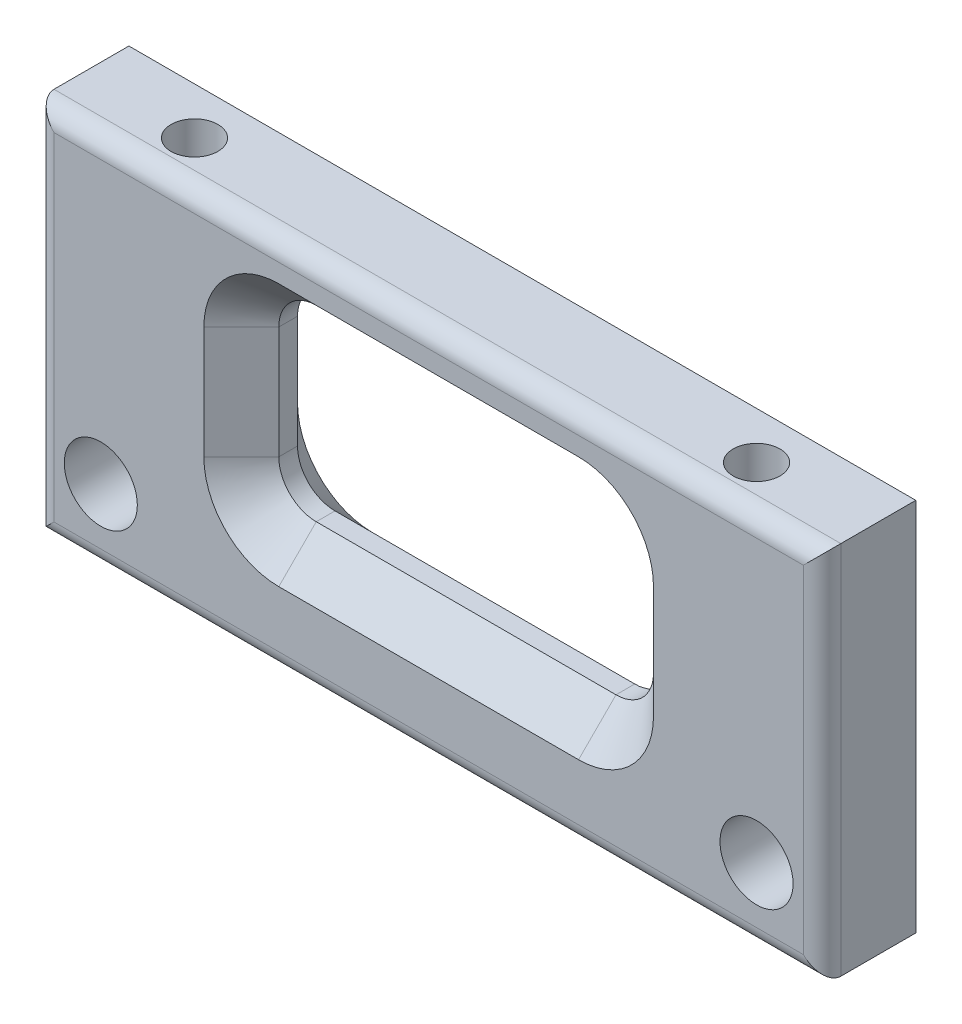
ISO-10303-21;
HEADER;
FILE_DESCRIPTION(('STEP AP214'),'2;1');
FILE_NAME('part.step','',(''),(''),'','','');
FILE_SCHEMA(('AUTOMOTIVE_DESIGN { 1 0 10303 214 1 1 1 1 }'));
ENDSEC;
DATA;
#1=APPLICATION_CONTEXT('core data for automotive mechanical design processes');
#2=APPLICATION_PROTOCOL_DEFINITION('international standard','automotive_design',2000,#1);
#3=PRODUCT_CONTEXT('',#1,'mechanical');
#4=PRODUCT('Part','Part','',(#3));
#5=PRODUCT_RELATED_PRODUCT_CATEGORY('part','',(#4));
#6=PRODUCT_DEFINITION_FORMATION('','',#4);
#7=PRODUCT_DEFINITION_CONTEXT('part definition',#1,'design');
#8=PRODUCT_DEFINITION('design','',#6,#7);
#9=PRODUCT_DEFINITION_SHAPE('','',#8);
#10=(LENGTH_UNIT() NAMED_UNIT(*) SI_UNIT(.MILLI.,.METRE.));
#11=(NAMED_UNIT(*) PLANE_ANGLE_UNIT() SI_UNIT($,.RADIAN.));
#12=(NAMED_UNIT(*) SI_UNIT($,.STERADIAN.) SOLID_ANGLE_UNIT());
#13=UNCERTAINTY_MEASURE_WITH_UNIT(LENGTH_MEASURE(1.E-05),#10,'distance_accuracy_value','');
#14=(GEOMETRIC_REPRESENTATION_CONTEXT(3) GLOBAL_UNCERTAINTY_ASSIGNED_CONTEXT((#13)) GLOBAL_UNIT_ASSIGNED_CONTEXT((#10,
#11,#12)) REPRESENTATION_CONTEXT('',''));
#15=CARTESIAN_POINT('',(0.,0.,0.));
#16=DIRECTION('',(0.,0.,1.));
#17=DIRECTION('',(1.,0.,0.));
#18=AXIS2_PLACEMENT_3D('',#15,#16,#17);
#19=CARTESIAN_POINT('',(0.,0.,5.));
#20=DIRECTION('',(0.,0.,1.));
#21=DIRECTION('',(1.,0.,0.));
#22=AXIS2_PLACEMENT_3D('',#19,#20,#21);
#23=PLANE('',#22);
#24=CARTESIAN_POINT('',(13.,-5.9903461742617,5.));
#25=DIRECTION('',(0.,0.,1.));
#26=DIRECTION('',(1.,0.,0.));
#27=AXIS2_PLACEMENT_3D('',#24,#25,#26);
#28=CIRCLE('',#27,4.00000000000001);
#29=CARTESIAN_POINT('',(8.99999999999999,-5.99034617426173,5.));
#30=VERTEX_POINT('',#29);
#31=CARTESIAN_POINT('',(13.,-1.99034617426169,5.));
#32=VERTEX_POINT('',#31);
#33=EDGE_CURVE('E51',#30,#32,#28,.F.);
#34=ORIENTED_EDGE('',*,*,#33,.T.);
#35=DIRECTION('',(1.,0.,0.));
#36=VECTOR('',#35,1.);
#37=CARTESIAN_POINT('',(29.,-1.99034617426169,5.));
#38=LINE('',#37,#36);
#39=CARTESIAN_POINT('',(29.,-1.99034617426169,5.));
#40=VERTEX_POINT('',#39);
#41=EDGE_CURVE('E11',#32,#40,#38,.T.);
#42=ORIENTED_EDGE('',*,*,#41,.T.);
#43=CARTESIAN_POINT('',(29.,-5.9903461742617,5.));
#44=DIRECTION('',(0.,0.,1.));
#45=DIRECTION('',(1.,0.,0.));
#46=AXIS2_PLACEMENT_3D('',#43,#44,#45);
#47=CIRCLE('',#46,4.00000000000001);
#48=CARTESIAN_POINT('',(33.,-5.99034617426172,5.));
#49=VERTEX_POINT('',#48);
#50=EDGE_CURVE('E323',#40,#49,#47,.F.);
#51=ORIENTED_EDGE('',*,*,#50,.T.);
#52=DIRECTION('',(0.,-1.,0.));
#53=VECTOR('',#52,1.);
#54=CARTESIAN_POINT('',(33.,-11.9903461742617,5.));
#55=LINE('',#54,#53);
#56=CARTESIAN_POINT('',(33.,-11.9903461742617,5.));
#57=VERTEX_POINT('',#56);
#58=EDGE_CURVE('E319',#49,#57,#55,.T.);
#59=ORIENTED_EDGE('',*,*,#58,.T.);
#60=CARTESIAN_POINT('',(29.,-11.9903461742617,5.));
#61=DIRECTION('',(0.,0.,1.));
#62=DIRECTION('',(1.,0.,0.));
#63=AXIS2_PLACEMENT_3D('',#60,#61,#62);
#64=CIRCLE('',#63,4.00000000000001);
#65=CARTESIAN_POINT('',(29.,-15.9903461742617,5.));
#66=VERTEX_POINT('',#65);
#67=EDGE_CURVE('E315',#57,#66,#64,.F.);
#68=ORIENTED_EDGE('',*,*,#67,.T.);
#69=DIRECTION('',(-1.,0.,0.));
#70=VECTOR('',#69,1.);
#71=CARTESIAN_POINT('',(13.,-15.9903461742617,5.));
#72=LINE('',#71,#70);
#73=CARTESIAN_POINT('',(13.,-15.9903461742617,5.));
#74=VERTEX_POINT('',#73);
#75=EDGE_CURVE('E313',#66,#74,#72,.T.);
#76=ORIENTED_EDGE('',*,*,#75,.T.);
#77=CARTESIAN_POINT('',(13.,-11.9903461742617,5.));
#78=DIRECTION('',(0.,0.,1.));
#79=DIRECTION('',(1.,0.,0.));
#80=AXIS2_PLACEMENT_3D('',#77,#78,#79);
#81=CIRCLE('',#80,4.00000000000001);
#82=CARTESIAN_POINT('',(8.99999999999999,-11.9903461742617,5.));
#83=VERTEX_POINT('',#82);
#84=EDGE_CURVE('E317',#74,#83,#81,.F.);
#85=ORIENTED_EDGE('',*,*,#84,.T.);
#86=DIRECTION('',(0.,1.,0.));
#87=VECTOR('',#86,1.);
#88=CARTESIAN_POINT('',(8.99999999999999,-5.99034617426171,5.));
#89=LINE('',#88,#87);
#90=EDGE_CURVE('E321',#83,#30,#89,.T.);
#91=ORIENTED_EDGE('',*,*,#90,.T.);
#92=EDGE_LOOP('',(#34,#42,#51,#59,#68,#76,#85,#91));
#93=FACE_BOUND('',#92,.T.);
#94=DIRECTION('',(1.,0.,0.));
#95=VECTOR('',#94,1.);
#96=CARTESIAN_POINT('',(42.,-19.,5.));
#97=LINE('',#96,#95);
#98=CARTESIAN_POINT('',(1.,-19.,5.));
#99=VERTEX_POINT('',#98);
#100=CARTESIAN_POINT('',(41.,-19.,5.));
#101=VERTEX_POINT('',#100);
#102=EDGE_CURVE('E204',#99,#101,#97,.T.);
#103=ORIENTED_EDGE('',*,*,#102,.T.);
#104=DIRECTION('',(0.,1.,0.));
#105=VECTOR('',#104,1.);
#106=CARTESIAN_POINT('',(41.,0.,5.));
#107=LINE('',#106,#105);
#108=CARTESIAN_POINT('',(41.,-1.,5.));
#109=VERTEX_POINT('',#108);
#110=EDGE_CURVE('E239',#101,#109,#107,.T.);
#111=ORIENTED_EDGE('',*,*,#110,.T.);
#112=DIRECTION('',(-1.,0.,0.));
#113=VECTOR('',#112,1.);
#114=CARTESIAN_POINT('',(0.,-1.,5.));
#115=LINE('',#114,#113);
#116=CARTESIAN_POINT('',(1.,-1.,5.));
#117=VERTEX_POINT('',#116);
#118=EDGE_CURVE('E237',#109,#117,#115,.T.);
#119=ORIENTED_EDGE('',*,*,#118,.T.);
#120=DIRECTION('',(0.,-1.,0.));
#121=VECTOR('',#120,1.);
#122=CARTESIAN_POINT('',(1.,-20.,5.));
#123=LINE('',#122,#121);
#124=EDGE_CURVE('E235',#117,#99,#123,.T.);
#125=ORIENTED_EDGE('',*,*,#124,.T.);
#126=EDGE_LOOP('',(#103,#111,#119,#125));
#127=FACE_BOUND('',#126,.T.);
#128=CARTESIAN_POINT('',(3.5,-16.,5.));
#129=DIRECTION('',(0.,0.,1.));
#130=DIRECTION('',(1.,0.,0.));
#131=AXIS2_PLACEMENT_3D('',#128,#129,#130);
#132=CIRCLE('',#131,1.95);
#133=CARTESIAN_POINT('',(5.45,-16.,5.));
#134=VERTEX_POINT('',#133);
#135=EDGE_CURVE('E220',#134,#134,#132,.T.);
#136=ORIENTED_EDGE('',*,*,#135,.F.);
#137=EDGE_LOOP('',(#136));
#138=FACE_BOUND('',#137,.T.);
#139=CARTESIAN_POINT('',(38.5,-16.,5.));
#140=DIRECTION('',(0.,0.,1.));
#141=DIRECTION('',(1.,0.,0.));
#142=AXIS2_PLACEMENT_3D('',#139,#140,#141);
#143=CIRCLE('',#142,1.95);
#144=CARTESIAN_POINT('',(40.45,-16.,5.));
#145=VERTEX_POINT('',#144);
#146=EDGE_CURVE('E429',#145,#145,#143,.T.);
#147=ORIENTED_EDGE('',*,*,#146,.F.);
#148=EDGE_LOOP('',(#147));
#149=FACE_BOUND('',#148,.T.);
#150=ADVANCED_FACE('F41',(#93,#127,#138,#149),#23,.T.);
#151=CARTESIAN_POINT('',(0.,0.,0.));
#152=DIRECTION('',(0.,0.,1.));
#153=DIRECTION('',(1.,0.,0.));
#154=AXIS2_PLACEMENT_3D('',#151,#152,#153);
#155=PLANE('',#154);
#156=CARTESIAN_POINT('',(29.,-5.9903461742617,0.));
#157=DIRECTION('',(0.,0.,1.));
#158=DIRECTION('',(1.,0.,0.));
#159=AXIS2_PLACEMENT_3D('',#156,#157,#158);
#160=CIRCLE('',#159,3.99999999999999);
#161=CARTESIAN_POINT('',(33.,-5.99034617426172,0.));
#162=VERTEX_POINT('',#161);
#163=CARTESIAN_POINT('',(29.,-1.9903461742617,0.));
#164=VERTEX_POINT('',#163);
#165=EDGE_CURVE('E272',#162,#164,#160,.T.);
#166=ORIENTED_EDGE('',*,*,#165,.T.);
#167=DIRECTION('',(-1.,0.,0.));
#168=VECTOR('',#167,1.);
#169=CARTESIAN_POINT('',(0.,-1.9903461742617,0.));
#170=LINE('',#169,#168);
#171=CARTESIAN_POINT('',(13.,-1.9903461742617,0.));
#172=VERTEX_POINT('',#171);
#173=EDGE_CURVE('E276',#164,#172,#170,.T.);
#174=ORIENTED_EDGE('',*,*,#173,.T.);
#175=CARTESIAN_POINT('',(13.,-5.9903461742617,0.));
#176=DIRECTION('',(0.,0.,1.));
#177=DIRECTION('',(1.,0.,0.));
#178=AXIS2_PLACEMENT_3D('',#175,#176,#177);
#179=CIRCLE('',#178,3.99999999999999);
#180=CARTESIAN_POINT('',(9.00000000000001,-5.99034617426173,0.));
#181=VERTEX_POINT('',#180);
#182=EDGE_CURVE('E274',#172,#181,#179,.T.);
#183=ORIENTED_EDGE('',*,*,#182,.T.);
#184=DIRECTION('',(0.,-1.,0.));
#185=VECTOR('',#184,1.);
#186=CARTESIAN_POINT('',(9.00000000000001,0.,0.));
#187=LINE('',#186,#185);
#188=CARTESIAN_POINT('',(9.,-11.9903461742617,0.));
#189=VERTEX_POINT('',#188);
#190=EDGE_CURVE('E270',#181,#189,#187,.T.);
#191=ORIENTED_EDGE('',*,*,#190,.T.);
#192=CARTESIAN_POINT('',(13.,-11.9903461742617,0.));
#193=DIRECTION('',(0.,0.,1.));
#194=DIRECTION('',(1.,0.,0.));
#195=AXIS2_PLACEMENT_3D('',#192,#193,#194);
#196=CIRCLE('',#195,4.);
#197=CARTESIAN_POINT('',(13.,-15.9903461742617,0.));
#198=VERTEX_POINT('',#197);
#199=EDGE_CURVE('E266',#189,#198,#196,.T.);
#200=ORIENTED_EDGE('',*,*,#199,.T.);
#201=DIRECTION('',(1.,0.,0.));
#202=VECTOR('',#201,1.);
#203=CARTESIAN_POINT('',(0.,-15.9903461742617,0.));
#204=LINE('',#203,#202);
#205=CARTESIAN_POINT('',(29.,-15.9903461742617,0.));
#206=VERTEX_POINT('',#205);
#207=EDGE_CURVE('E250',#198,#206,#204,.T.);
#208=ORIENTED_EDGE('',*,*,#207,.T.);
#209=CARTESIAN_POINT('',(29.,-11.9903461742617,0.));
#210=DIRECTION('',(0.,0.,1.));
#211=DIRECTION('',(1.,0.,0.));
#212=AXIS2_PLACEMENT_3D('',#209,#210,#211);
#213=CIRCLE('',#212,4.);
#214=CARTESIAN_POINT('',(33.,-11.9903461742617,0.));
#215=VERTEX_POINT('',#214);
#216=EDGE_CURVE('E264',#206,#215,#213,.T.);
#217=ORIENTED_EDGE('',*,*,#216,.T.);
#218=DIRECTION('',(0.,1.,0.));
#219=VECTOR('',#218,1.);
#220=CARTESIAN_POINT('',(33.,0.,0.));
#221=LINE('',#220,#219);
#222=EDGE_CURVE('E268',#215,#162,#221,.T.);
#223=ORIENTED_EDGE('',*,*,#222,.T.);
#224=EDGE_LOOP('',(#166,#174,#183,#191,#200,#208,#217,#223));
#225=FACE_BOUND('',#224,.T.);
#226=DIRECTION('',(0.,-1.,0.));
#227=VECTOR('',#226,1.);
#228=CARTESIAN_POINT('',(0.,0.,0.));
#229=LINE('',#228,#227);
#230=CARTESIAN_POINT('',(0.,0.,0.));
#231=VERTEX_POINT('',#230);
#232=CARTESIAN_POINT('',(0.,-20.,0.));
#233=VERTEX_POINT('',#232);
#234=EDGE_CURVE('E212',#231,#233,#229,.T.);
#235=ORIENTED_EDGE('',*,*,#234,.F.);
#236=DIRECTION('',(-1.,0.,0.));
#237=VECTOR('',#236,1.);
#238=CARTESIAN_POINT('',(0.,0.,0.));
#239=LINE('',#238,#237);
#240=CARTESIAN_POINT('',(42.,0.,0.));
#241=VERTEX_POINT('',#240);
#242=EDGE_CURVE('E228',#241,#231,#239,.T.);
#243=ORIENTED_EDGE('',*,*,#242,.F.);
#244=DIRECTION('',(0.,1.,0.));
#245=VECTOR('',#244,1.);
#246=CARTESIAN_POINT('',(42.,0.,0.));
#247=LINE('',#246,#245);
#248=CARTESIAN_POINT('',(42.,-20.,0.));
#249=VERTEX_POINT('',#248);
#250=EDGE_CURVE('E214',#249,#241,#247,.T.);
#251=ORIENTED_EDGE('',*,*,#250,.F.);
#252=DIRECTION('',(1.,0.,0.));
#253=VECTOR('',#252,1.);
#254=CARTESIAN_POINT('',(0.,-20.,0.));
#255=LINE('',#254,#253);
#256=EDGE_CURVE('E197',#233,#249,#255,.T.);
#257=ORIENTED_EDGE('',*,*,#256,.F.);
#258=EDGE_LOOP('',(#235,#243,#251,#257));
#259=FACE_BOUND('',#258,.T.);
#260=CARTESIAN_POINT('',(3.5,-16.,0.));
#261=DIRECTION('',(0.,0.,1.));
#262=DIRECTION('',(1.,0.,0.));
#263=AXIS2_PLACEMENT_3D('',#260,#261,#262);
#264=CIRCLE('',#263,1.95);
#265=CARTESIAN_POINT('',(5.45,-16.,0.));
#266=VERTEX_POINT('',#265);
#267=EDGE_CURVE('E223',#266,#266,#264,.T.);
#268=ORIENTED_EDGE('',*,*,#267,.T.);
#269=EDGE_LOOP('',(#268));
#270=FACE_BOUND('',#269,.T.);
#271=CARTESIAN_POINT('',(38.5,-16.,0.));
#272=DIRECTION('',(0.,0.,1.));
#273=DIRECTION('',(1.,0.,0.));
#274=AXIS2_PLACEMENT_3D('',#271,#272,#273);
#275=CIRCLE('',#274,1.95);
#276=CARTESIAN_POINT('',(40.45,-16.,0.));
#277=VERTEX_POINT('',#276);
#278=EDGE_CURVE('E418',#277,#277,#275,.T.);
#279=ORIENTED_EDGE('',*,*,#278,.T.);
#280=EDGE_LOOP('',(#279));
#281=FACE_BOUND('',#280,.T.);
#282=ADVANCED_FACE('F209',(#225,#259,#270,#281),#155,.F.);
#283=CARTESIAN_POINT('',(0.,0.,5.));
#284=DIRECTION('',(1.,0.,0.));
#285=DIRECTION('',(0.,1.,0.));
#286=AXIS2_PLACEMENT_3D('',#283,#284,#285);
#287=PLANE('',#286);
#288=DIRECTION('',(0.,0.,-1.));
#289=VECTOR('',#288,1.);
#290=CARTESIAN_POINT('',(0.,-20.,5.));
#291=LINE('',#290,#289);
#292=CARTESIAN_POINT('',(0.,-20.,4.));
#293=VERTEX_POINT('',#292);
#294=EDGE_CURVE('E193',#293,#233,#291,.T.);
#295=ORIENTED_EDGE('',*,*,#294,.F.);
#296=DIRECTION('',(0.,-1.,0.));
#297=VECTOR('',#296,1.);
#298=CARTESIAN_POINT('',(0.,0.,4.));
#299=LINE('',#298,#297);
#300=CARTESIAN_POINT('',(0.,0.,4.));
#301=VERTEX_POINT('',#300);
#302=EDGE_CURVE('E247',#293,#301,#299,.F.);
#303=ORIENTED_EDGE('',*,*,#302,.T.);
#304=DIRECTION('',(0.,0.,-1.));
#305=VECTOR('',#304,1.);
#306=CARTESIAN_POINT('',(0.,0.,5.));
#307=LINE('',#306,#305);
#308=EDGE_CURVE('E218',#301,#231,#307,.T.);
#309=ORIENTED_EDGE('',*,*,#308,.T.);
#310=ORIENTED_EDGE('',*,*,#234,.T.);
#311=EDGE_LOOP('',(#295,#303,#309,#310));
#312=FACE_BOUND('',#311,.T.);
#313=ADVANCED_FACE('F216',(#312),#287,.F.);
#314=CARTESIAN_POINT('',(0.,-20.,5.));
#315=DIRECTION('',(0.,1.,0.));
#316=DIRECTION('',(0.,0.,1.));
#317=AXIS2_PLACEMENT_3D('',#314,#315,#316);
#318=PLANE('',#317);
#319=DIRECTION('',(0.,0.,-1.));
#320=VECTOR('',#319,1.);
#321=CARTESIAN_POINT('',(42.,-20.,5.));
#322=LINE('',#321,#320);
#323=CARTESIAN_POINT('',(42.,-20.,4.));
#324=VERTEX_POINT('',#323);
#325=EDGE_CURVE('E205',#324,#249,#322,.T.);
#326=ORIENTED_EDGE('',*,*,#325,.F.);
#327=DIRECTION('',(1.,0.,0.));
#328=VECTOR('',#327,1.);
#329=CARTESIAN_POINT('',(0.,-20.,4.));
#330=LINE('',#329,#328);
#331=EDGE_CURVE('E200',#324,#293,#330,.F.);
#332=ORIENTED_EDGE('',*,*,#331,.T.);
#333=ORIENTED_EDGE('',*,*,#294,.T.);
#334=ORIENTED_EDGE('',*,*,#256,.T.);
#335=EDGE_LOOP('',(#326,#332,#333,#334));
#336=FACE_BOUND('',#335,.T.);
#337=ADVANCED_FACE('F196',(#336),#318,.F.);
#338=CARTESIAN_POINT('',(42.,0.,5.));
#339=DIRECTION('',(-1.,0.,0.));
#340=DIRECTION('',(0.,0.,1.));
#341=AXIS2_PLACEMENT_3D('',#338,#339,#340);
#342=PLANE('',#341);
#343=DIRECTION('',(0.,0.,-1.));
#344=VECTOR('',#343,1.);
#345=CARTESIAN_POINT('',(42.,0.,5.));
#346=LINE('',#345,#344);
#347=CARTESIAN_POINT('',(42.,0.,4.));
#348=VERTEX_POINT('',#347);
#349=EDGE_CURVE('E231',#348,#241,#346,.T.);
#350=ORIENTED_EDGE('',*,*,#349,.F.);
#351=DIRECTION('',(0.,1.,0.));
#352=VECTOR('',#351,1.);
#353=CARTESIAN_POINT('',(42.,-20.,4.));
#354=LINE('',#353,#352);
#355=EDGE_CURVE('E242',#348,#324,#354,.F.);
#356=ORIENTED_EDGE('',*,*,#355,.T.);
#357=ORIENTED_EDGE('',*,*,#325,.T.);
#358=ORIENTED_EDGE('',*,*,#250,.T.);
#359=EDGE_LOOP('',(#350,#356,#357,#358));
#360=FACE_BOUND('',#359,.T.);
#361=ADVANCED_FACE('F464',(#360),#342,.F.);
#362=CARTESIAN_POINT('',(0.,0.,5.));
#363=DIRECTION('',(0.,-1.,0.));
#364=DIRECTION('',(0.,0.,-1.));
#365=AXIS2_PLACEMENT_3D('',#362,#363,#364);
#366=PLANE('',#365);
#367=CARTESIAN_POINT('',(36.,0.,2.5));
#368=DIRECTION('',(0.,1.,0.));
#369=DIRECTION('',(0.,0.,1.));
#370=AXIS2_PLACEMENT_3D('',#367,#368,#369);
#371=CIRCLE('',#370,1.25);
#372=CARTESIAN_POINT('',(36.,0.,3.75));
#373=VERTEX_POINT('',#372);
#374=EDGE_CURVE('E419',#373,#373,#371,.T.);
#375=ORIENTED_EDGE('',*,*,#374,.F.);
#376=EDGE_LOOP('',(#375));
#377=FACE_BOUND('',#376,.T.);
#378=CARTESIAN_POINT('',(6.,0.,2.5));
#379=DIRECTION('',(0.,1.,0.));
#380=DIRECTION('',(0.,0.,1.));
#381=AXIS2_PLACEMENT_3D('',#378,#379,#380);
#382=CIRCLE('',#381,1.25);
#383=CARTESIAN_POINT('',(6.,0.,3.75));
#384=VERTEX_POINT('',#383);
#385=EDGE_CURVE('E422',#384,#384,#382,.T.);
#386=ORIENTED_EDGE('',*,*,#385,.F.);
#387=EDGE_LOOP('',(#386));
#388=FACE_BOUND('',#387,.T.);
#389=ORIENTED_EDGE('',*,*,#308,.F.);
#390=DIRECTION('',(-1.,0.,0.));
#391=VECTOR('',#390,1.);
#392=CARTESIAN_POINT('',(42.,0.,4.));
#393=LINE('',#392,#391);
#394=EDGE_CURVE('E245',#301,#348,#393,.F.);
#395=ORIENTED_EDGE('',*,*,#394,.T.);
#396=ORIENTED_EDGE('',*,*,#349,.T.);
#397=ORIENTED_EDGE('',*,*,#242,.T.);
#398=EDGE_LOOP('',(#389,#395,#396,#397));
#399=FACE_BOUND('',#398,.T.);
#400=ADVANCED_FACE('F449',(#377,#388,#399),#366,.F.);
#401=CARTESIAN_POINT('',(3.5,-16.,5.));
#402=DIRECTION('',(0.,0.,-1.));
#403=DIRECTION('',(-1.,0.,0.));
#404=AXIS2_PLACEMENT_3D('',#401,#402,#403);
#405=CYLINDRICAL_SURFACE('',#404,1.95);
#406=ORIENTED_EDGE('',*,*,#135,.T.);
#407=EDGE_LOOP('',(#406));
#408=FACE_BOUND('',#407,.T.);
#409=ORIENTED_EDGE('',*,*,#267,.F.);
#410=EDGE_LOOP('',(#409));
#411=FACE_BOUND('',#410,.T.);
#412=ADVANCED_FACE('F439',(#408,#411),#405,.F.);
#413=CARTESIAN_POINT('',(38.5,-16.,5.));
#414=DIRECTION('',(0.,0.,-1.));
#415=DIRECTION('',(-1.,0.,0.));
#416=AXIS2_PLACEMENT_3D('',#413,#414,#415);
#417=CYLINDRICAL_SURFACE('',#416,1.95);
#418=ORIENTED_EDGE('',*,*,#146,.T.);
#419=EDGE_LOOP('',(#418));
#420=FACE_BOUND('',#419,.T.);
#421=ORIENTED_EDGE('',*,*,#278,.F.);
#422=EDGE_LOOP('',(#421));
#423=FACE_BOUND('',#422,.T.);
#424=ADVANCED_FACE('F436',(#420,#423),#417,.F.);
#425=CARTESIAN_POINT('',(6.,-10.,2.5));
#426=DIRECTION('',(0.,1.,0.));
#427=DIRECTION('',(0.,0.,1.));
#428=AXIS2_PLACEMENT_3D('',#425,#426,#427);
#429=CYLINDRICAL_SURFACE('',#428,1.25);
#430=CARTESIAN_POINT('',(6.,-10.,2.5));
#431=DIRECTION('',(0.,1.,0.));
#432=DIRECTION('',(0.,0.,1.));
#433=AXIS2_PLACEMENT_3D('',#430,#431,#432);
#434=CIRCLE('',#433,1.25);
#435=CARTESIAN_POINT('',(6.,-10.,3.75));
#436=VERTEX_POINT('',#435);
#437=EDGE_CURVE('E425',#436,#436,#434,.T.);
#438=ORIENTED_EDGE('',*,*,#437,.F.);
#439=EDGE_LOOP('',(#438));
#440=FACE_BOUND('',#439,.T.);
#441=ORIENTED_EDGE('',*,*,#385,.T.);
#442=EDGE_LOOP('',(#441));
#443=FACE_BOUND('',#442,.T.);
#444=ADVANCED_FACE('F438',(#440,#443),#429,.F.);
#445=CARTESIAN_POINT('',(6.,-10.,2.5));
#446=DIRECTION('',(0.,1.,0.));
#447=DIRECTION('',(0.,0.,1.));
#448=AXIS2_PLACEMENT_3D('',#445,#446,#447);
#449=PLANE('',#448);
#450=ORIENTED_EDGE('',*,*,#437,.T.);
#451=EDGE_LOOP('',(#450));
#452=FACE_BOUND('',#451,.T.);
#453=ADVANCED_FACE('F446',(#452),#449,.T.);
#454=CARTESIAN_POINT('',(36.,-10.,2.5));
#455=DIRECTION('',(0.,1.,0.));
#456=DIRECTION('',(0.,0.,1.));
#457=AXIS2_PLACEMENT_3D('',#454,#455,#456);
#458=CYLINDRICAL_SURFACE('',#457,1.25);
#459=CARTESIAN_POINT('',(36.,-10.,2.5));
#460=DIRECTION('',(0.,1.,0.));
#461=DIRECTION('',(0.,0.,1.));
#462=AXIS2_PLACEMENT_3D('',#459,#460,#461);
#463=CIRCLE('',#462,1.25);
#464=CARTESIAN_POINT('',(36.,-10.,3.75));
#465=VERTEX_POINT('',#464);
#466=EDGE_CURVE('E415',#465,#465,#463,.T.);
#467=ORIENTED_EDGE('',*,*,#466,.F.);
#468=EDGE_LOOP('',(#467));
#469=FACE_BOUND('',#468,.T.);
#470=ORIENTED_EDGE('',*,*,#374,.T.);
#471=EDGE_LOOP('',(#470));
#472=FACE_BOUND('',#471,.T.);
#473=ADVANCED_FACE('F759',(#469,#472),#458,.F.);
#474=CARTESIAN_POINT('',(36.,-10.,2.5));
#475=DIRECTION('',(0.,1.,0.));
#476=DIRECTION('',(0.,0.,1.));
#477=AXIS2_PLACEMENT_3D('',#474,#475,#476);
#478=PLANE('',#477);
#479=ORIENTED_EDGE('',*,*,#466,.T.);
#480=EDGE_LOOP('',(#479));
#481=FACE_BOUND('',#480,.T.);
#482=ADVANCED_FACE('F696',(#481),#478,.T.);
#483=CARTESIAN_POINT('',(13.,-11.9903461742617,-5.));
#484=DIRECTION('',(0.,0.,1.));
#485=DIRECTION('',(1.,0.,0.));
#486=AXIS2_PLACEMENT_3D('',#483,#484,#485);
#487=CYLINDRICAL_SURFACE('',#486,2.);
#488=DIRECTION('',(0.,0.,1.));
#489=VECTOR('',#488,1.);
#490=CARTESIAN_POINT('',(13.,-13.9903461742617,-5.));
#491=LINE('',#490,#489);
#492=CARTESIAN_POINT('',(13.,-13.9903461742617,2.00000000000001));
#493=VERTEX_POINT('',#492);
#494=CARTESIAN_POINT('',(13.,-13.9903461742617,3.00000000000001));
#495=VERTEX_POINT('',#494);
#496=EDGE_CURVE('E262',#493,#495,#491,.T.);
#497=ORIENTED_EDGE('',*,*,#496,.F.);
#498=CARTESIAN_POINT('',(13.,-11.9903461742617,2.00000000000001));
#499=DIRECTION('',(0.,0.,1.));
#500=DIRECTION('',(1.,0.,0.));
#501=AXIS2_PLACEMENT_3D('',#498,#499,#500);
#502=CIRCLE('',#501,2.);
#503=CARTESIAN_POINT('',(11.,-11.9903461742617,2.00000000000001));
#504=VERTEX_POINT('',#503);
#505=EDGE_CURVE('E303',#493,#504,#502,.F.);
#506=ORIENTED_EDGE('',*,*,#505,.T.);
#507=DIRECTION('',(0.,0.,1.));
#508=VECTOR('',#507,1.);
#509=CARTESIAN_POINT('',(11.,-11.9903461742617,-5.));
#510=LINE('',#509,#508);
#511=CARTESIAN_POINT('',(11.,-11.9903461742617,3.00000000000001));
#512=VERTEX_POINT('',#511);
#513=EDGE_CURVE('E428',#504,#512,#510,.T.);
#514=ORIENTED_EDGE('',*,*,#513,.T.);
#515=CARTESIAN_POINT('',(13.,-11.9903461742617,3.00000000000001));
#516=DIRECTION('',(0.,0.,1.));
#517=DIRECTION('',(1.,0.,0.));
#518=AXIS2_PLACEMENT_3D('',#515,#516,#517);
#519=CIRCLE('',#518,2.);
#520=EDGE_CURVE('E301',#512,#495,#519,.T.);
#521=ORIENTED_EDGE('',*,*,#520,.T.);
#522=EDGE_LOOP('',(#497,#506,#514,#521));
#523=FACE_BOUND('',#522,.T.);
#524=ADVANCED_FACE('F688',(#523),#487,.F.);
#525=CARTESIAN_POINT('',(11.,-11.9903461742617,-5.));
#526=DIRECTION('',(-1.,0.,0.));
#527=DIRECTION('',(0.,0.,1.));
#528=AXIS2_PLACEMENT_3D('',#525,#526,#527);
#529=PLANE('',#528);
#530=ORIENTED_EDGE('',*,*,#513,.F.);
#531=DIRECTION('',(0.,1.,0.));
#532=VECTOR('',#531,1.);
#533=CARTESIAN_POINT('',(11.,-11.9903461742617,2.00000000000001));
#534=LINE('',#533,#532);
#535=CARTESIAN_POINT('',(11.,-5.99034617426171,2.00000000000001));
#536=VERTEX_POINT('',#535);
#537=EDGE_CURVE('E295',#504,#536,#534,.T.);
#538=ORIENTED_EDGE('',*,*,#537,.T.);
#539=DIRECTION('',(0.,0.,1.));
#540=VECTOR('',#539,1.);
#541=CARTESIAN_POINT('',(11.,-5.99034617426171,-5.));
#542=LINE('',#541,#540);
#543=CARTESIAN_POINT('',(11.,-5.99034617426171,3.00000000000001));
#544=VERTEX_POINT('',#543);
#545=EDGE_CURVE('E402',#536,#544,#542,.T.);
#546=ORIENTED_EDGE('',*,*,#545,.T.);
#547=DIRECTION('',(0.,-1.,0.));
#548=VECTOR('',#547,1.);
#549=CARTESIAN_POINT('',(11.,-11.9903461742617,3.00000000000001));
#550=LINE('',#549,#548);
#551=EDGE_CURVE('E293',#544,#512,#550,.T.);
#552=ORIENTED_EDGE('',*,*,#551,.T.);
#553=EDGE_LOOP('',(#530,#538,#546,#552));
#554=FACE_BOUND('',#553,.T.);
#555=ADVANCED_FACE('F679',(#554),#529,.F.);
#556=CARTESIAN_POINT('',(13.,-5.9903461742617,-5.));
#557=DIRECTION('',(0.,0.,1.));
#558=DIRECTION('',(1.,0.,0.));
#559=AXIS2_PLACEMENT_3D('',#556,#557,#558);
#560=CYLINDRICAL_SURFACE('',#559,2.);
#561=ORIENTED_EDGE('',*,*,#545,.F.);
#562=CARTESIAN_POINT('',(13.,-5.9903461742617,2.00000000000001));
#563=DIRECTION('',(0.,0.,1.));
#564=DIRECTION('',(1.,0.,0.));
#565=AXIS2_PLACEMENT_3D('',#562,#563,#564);
#566=CIRCLE('',#565,2.);
#567=CARTESIAN_POINT('',(13.,-3.9903461742617,2.00000000000001));
#568=VERTEX_POINT('',#567);
#569=EDGE_CURVE('E287',#536,#568,#566,.F.);
#570=ORIENTED_EDGE('',*,*,#569,.T.);
#571=DIRECTION('',(0.,0.,1.));
#572=VECTOR('',#571,1.);
#573=CARTESIAN_POINT('',(13.,-3.9903461742617,-5.));
#574=LINE('',#573,#572);
#575=CARTESIAN_POINT('',(13.,-3.9903461742617,3.00000000000001));
#576=VERTEX_POINT('',#575);
#577=EDGE_CURVE('E400',#568,#576,#574,.T.);
#578=ORIENTED_EDGE('',*,*,#577,.T.);
#579=CARTESIAN_POINT('',(13.,-5.9903461742617,3.00000000000001));
#580=DIRECTION('',(0.,0.,1.));
#581=DIRECTION('',(1.,0.,0.));
#582=AXIS2_PLACEMENT_3D('',#579,#580,#581);
#583=CIRCLE('',#582,2.);
#584=EDGE_CURVE('E285',#576,#544,#583,.T.);
#585=ORIENTED_EDGE('',*,*,#584,.T.);
#586=EDGE_LOOP('',(#561,#570,#578,#585));
#587=FACE_BOUND('',#586,.T.);
#588=ADVANCED_FACE('F671',(#587),#560,.F.);
#589=CARTESIAN_POINT('',(29.,-3.9903461742617,-5.));
#590=DIRECTION('',(0.,1.,0.));
#591=DIRECTION('',(-1.,0.,0.));
#592=AXIS2_PLACEMENT_3D('',#589,#590,#591);
#593=PLANE('',#592);
#594=ORIENTED_EDGE('',*,*,#577,.F.);
#595=DIRECTION('',(1.,0.,0.));
#596=VECTOR('',#595,1.);
#597=CARTESIAN_POINT('',(29.,-3.9903461742617,2.00000000000001));
#598=LINE('',#597,#596);
#599=CARTESIAN_POINT('',(29.,-3.9903461742617,2.00000000000001));
#600=VERTEX_POINT('',#599);
#601=EDGE_CURVE('E282',#568,#600,#598,.T.);
#602=ORIENTED_EDGE('',*,*,#601,.T.);
#603=DIRECTION('',(0.,0.,1.));
#604=VECTOR('',#603,1.);
#605=CARTESIAN_POINT('',(29.,-3.9903461742617,-5.));
#606=LINE('',#605,#604);
#607=CARTESIAN_POINT('',(29.,-3.9903461742617,3.00000000000001));
#608=VERTEX_POINT('',#607);
#609=EDGE_CURVE('E392',#600,#608,#606,.T.);
#610=ORIENTED_EDGE('',*,*,#609,.T.);
#611=DIRECTION('',(-1.,0.,0.));
#612=VECTOR('',#611,1.);
#613=CARTESIAN_POINT('',(13.,-3.9903461742617,3.00000000000001));
#614=LINE('',#613,#612);
#615=EDGE_CURVE('E279',#608,#576,#614,.T.);
#616=ORIENTED_EDGE('',*,*,#615,.T.);
#617=EDGE_LOOP('',(#594,#602,#610,#616));
#618=FACE_BOUND('',#617,.T.);
#619=ADVANCED_FACE('F397',(#618),#593,.F.);
#620=CARTESIAN_POINT('',(29.,-5.9903461742617,-5.));
#621=DIRECTION('',(0.,0.,1.));
#622=DIRECTION('',(1.,0.,0.));
#623=AXIS2_PLACEMENT_3D('',#620,#621,#622);
#624=CYLINDRICAL_SURFACE('',#623,2.);
#625=ORIENTED_EDGE('',*,*,#609,.F.);
#626=CARTESIAN_POINT('',(29.,-5.9903461742617,2.00000000000001));
#627=DIRECTION('',(0.,0.,1.));
#628=DIRECTION('',(1.,0.,0.));
#629=AXIS2_PLACEMENT_3D('',#626,#627,#628);
#630=CIRCLE('',#629,2.);
#631=CARTESIAN_POINT('',(31.,-5.99034617426171,2.00000000000001));
#632=VERTEX_POINT('',#631);
#633=EDGE_CURVE('E291',#600,#632,#630,.F.);
#634=ORIENTED_EDGE('',*,*,#633,.T.);
#635=DIRECTION('',(0.,0.,1.));
#636=VECTOR('',#635,1.);
#637=CARTESIAN_POINT('',(31.,-5.99034617426171,-5.));
#638=LINE('',#637,#636);
#639=CARTESIAN_POINT('',(31.,-5.99034617426171,3.00000000000001));
#640=VERTEX_POINT('',#639);
#641=EDGE_CURVE('E394',#632,#640,#638,.T.);
#642=ORIENTED_EDGE('',*,*,#641,.T.);
#643=CARTESIAN_POINT('',(29.,-5.9903461742617,3.00000000000001));
#644=DIRECTION('',(0.,0.,1.));
#645=DIRECTION('',(1.,0.,0.));
#646=AXIS2_PLACEMENT_3D('',#643,#644,#645);
#647=CIRCLE('',#646,2.);
#648=EDGE_CURVE('E289',#640,#608,#647,.T.);
#649=ORIENTED_EDGE('',*,*,#648,.T.);
#650=EDGE_LOOP('',(#625,#634,#642,#649));
#651=FACE_BOUND('',#650,.T.);
#652=ADVANCED_FACE('F391',(#651),#624,.F.);
#653=CARTESIAN_POINT('',(31.,-11.9903461742617,-5.));
#654=DIRECTION('',(1.,0.,0.));
#655=DIRECTION('',(0.,0.,-1.));
#656=AXIS2_PLACEMENT_3D('',#653,#654,#655);
#657=PLANE('',#656);
#658=ORIENTED_EDGE('',*,*,#641,.F.);
#659=DIRECTION('',(0.,-1.,0.));
#660=VECTOR('',#659,1.);
#661=CARTESIAN_POINT('',(31.,-11.9903461742617,2.00000000000001));
#662=LINE('',#661,#660);
#663=CARTESIAN_POINT('',(31.,-11.9903461742617,2.00000000000001));
#664=VERTEX_POINT('',#663);
#665=EDGE_CURVE('E299',#632,#664,#662,.T.);
#666=ORIENTED_EDGE('',*,*,#665,.T.);
#667=DIRECTION('',(0.,0.,1.));
#668=VECTOR('',#667,1.);
#669=CARTESIAN_POINT('',(31.,-11.9903461742617,-5.));
#670=LINE('',#669,#668);
#671=CARTESIAN_POINT('',(31.,-11.9903461742617,3.00000000000001));
#672=VERTEX_POINT('',#671);
#673=EDGE_CURVE('E404',#664,#672,#670,.T.);
#674=ORIENTED_EDGE('',*,*,#673,.T.);
#675=DIRECTION('',(0.,1.,0.));
#676=VECTOR('',#675,1.);
#677=CARTESIAN_POINT('',(31.,-5.99034617426171,3.00000000000001));
#678=LINE('',#677,#676);
#679=EDGE_CURVE('E297',#672,#640,#678,.T.);
#680=ORIENTED_EDGE('',*,*,#679,.T.);
#681=EDGE_LOOP('',(#658,#666,#674,#680));
#682=FACE_BOUND('',#681,.T.);
#683=ADVANCED_FACE('F647',(#682),#657,.F.);
#684=CARTESIAN_POINT('',(29.,-11.9903461742617,-5.));
#685=DIRECTION('',(0.,0.,1.));
#686=DIRECTION('',(1.,0.,0.));
#687=AXIS2_PLACEMENT_3D('',#684,#685,#686);
#688=CYLINDRICAL_SURFACE('',#687,2.);
#689=ORIENTED_EDGE('',*,*,#673,.F.);
#690=CARTESIAN_POINT('',(29.,-11.9903461742617,2.00000000000001));
#691=DIRECTION('',(0.,0.,1.));
#692=DIRECTION('',(1.,0.,0.));
#693=AXIS2_PLACEMENT_3D('',#690,#691,#692);
#694=CIRCLE('',#693,2.);
#695=CARTESIAN_POINT('',(29.,-13.9903461742617,2.00000000000001));
#696=VERTEX_POINT('',#695);
#697=EDGE_CURVE('E307',#664,#696,#694,.F.);
#698=ORIENTED_EDGE('',*,*,#697,.T.);
#699=DIRECTION('',(0.,0.,1.));
#700=VECTOR('',#699,1.);
#701=CARTESIAN_POINT('',(29.,-13.9903461742617,-5.));
#702=LINE('',#701,#700);
#703=CARTESIAN_POINT('',(29.,-13.9903461742617,3.00000000000001));
#704=VERTEX_POINT('',#703);
#705=EDGE_CURVE('E410',#696,#704,#702,.T.);
#706=ORIENTED_EDGE('',*,*,#705,.T.);
#707=CARTESIAN_POINT('',(29.,-11.9903461742617,3.00000000000001));
#708=DIRECTION('',(0.,0.,1.));
#709=DIRECTION('',(1.,0.,0.));
#710=AXIS2_PLACEMENT_3D('',#707,#708,#709);
#711=CIRCLE('',#710,2.);
#712=EDGE_CURVE('E305',#704,#672,#711,.T.);
#713=ORIENTED_EDGE('',*,*,#712,.T.);
#714=EDGE_LOOP('',(#689,#698,#706,#713));
#715=FACE_BOUND('',#714,.T.);
#716=ADVANCED_FACE('F637',(#715),#688,.F.);
#717=CARTESIAN_POINT('',(29.,-13.9903461742617,-5.));
#718=DIRECTION('',(0.,-1.,0.));
#719=DIRECTION('',(1.,0.,0.));
#720=AXIS2_PLACEMENT_3D('',#717,#718,#719);
#721=PLANE('',#720);
#722=ORIENTED_EDGE('',*,*,#705,.F.);
#723=DIRECTION('',(-1.,0.,0.));
#724=VECTOR('',#723,1.);
#725=CARTESIAN_POINT('',(29.,-13.9903461742617,2.00000000000001));
#726=LINE('',#725,#724);
#727=EDGE_CURVE('E311',#696,#493,#726,.T.);
#728=ORIENTED_EDGE('',*,*,#727,.T.);
#729=ORIENTED_EDGE('',*,*,#496,.T.);
#730=DIRECTION('',(1.,0.,0.));
#731=VECTOR('',#730,1.);
#732=CARTESIAN_POINT('',(29.,-13.9903461742617,3.00000000000001));
#733=LINE('',#732,#731);
#734=EDGE_CURVE('E309',#495,#704,#733,.T.);
#735=ORIENTED_EDGE('',*,*,#734,.T.);
#736=EDGE_LOOP('',(#722,#728,#729,#735));
#737=FACE_BOUND('',#736,.T.);
#738=ADVANCED_FACE('F488',(#737),#721,.F.);
#739=CARTESIAN_POINT('',(1.,0.,4.));
#740=DIRECTION('',(0.,1.,0.));
#741=DIRECTION('',(-1.,0.,0.));
#742=AXIS2_PLACEMENT_3D('',#739,#740,#741);
#743=CYLINDRICAL_SURFACE('',#742,1.);
#744=CARTESIAN_POINT('',(1.,-1.,4.));
#745=DIRECTION('',(0.707106781186547,0.707106781186548,0.));
#746=DIRECTION('',(-0.707106781186548,0.707106781186547,0.));
#747=AXIS2_PLACEMENT_3D('',#744,#745,#746);
#748=ELLIPSE('',#747,1.4142135623731,1.);
#749=EDGE_CURVE('E256',#301,#117,#748,.T.);
#750=ORIENTED_EDGE('',*,*,#749,.F.);
#751=ORIENTED_EDGE('',*,*,#302,.F.);
#752=CARTESIAN_POINT('',(1.,-19.,4.));
#753=DIRECTION('',(-0.707106781186548,0.707106781186547,0.));
#754=DIRECTION('',(-0.707106781186547,-0.707106781186548,0.));
#755=AXIS2_PLACEMENT_3D('',#752,#753,#754);
#756=ELLIPSE('',#755,1.41421356237309,1.);
#757=EDGE_CURVE('E259',#99,#293,#756,.F.);
#758=ORIENTED_EDGE('',*,*,#757,.F.);
#759=ORIENTED_EDGE('',*,*,#124,.F.);
#760=EDGE_LOOP('',(#750,#751,#758,#759));
#761=FACE_BOUND('',#760,.T.);
#762=ADVANCED_FACE('F484',(#761),#743,.T.);
#763=CARTESIAN_POINT('',(0.,-19.,4.));
#764=DIRECTION('',(-1.,0.,0.));
#765=DIRECTION('',(0.,0.,1.));
#766=AXIS2_PLACEMENT_3D('',#763,#764,#765);
#767=CYLINDRICAL_SURFACE('',#766,1.);
#768=ORIENTED_EDGE('',*,*,#757,.T.);
#769=ORIENTED_EDGE('',*,*,#331,.F.);
#770=CARTESIAN_POINT('',(41.,-19.,4.));
#771=DIRECTION('',(-0.707106781186547,-0.707106781186547,0.));
#772=DIRECTION('',(-0.707106781186547,0.707106781186547,0.));
#773=AXIS2_PLACEMENT_3D('',#770,#771,#772);
#774=ELLIPSE('',#773,1.41421356237309,1.);
#775=EDGE_CURVE('E253',#101,#324,#774,.F.);
#776=ORIENTED_EDGE('',*,*,#775,.F.);
#777=ORIENTED_EDGE('',*,*,#102,.F.);
#778=EDGE_LOOP('',(#768,#769,#776,#777));
#779=FACE_BOUND('',#778,.T.);
#780=ADVANCED_FACE('F480',(#779),#767,.T.);
#781=CARTESIAN_POINT('',(0.,-1.,4.));
#782=DIRECTION('',(1.,0.,0.));
#783=DIRECTION('',(0.,0.,-1.));
#784=AXIS2_PLACEMENT_3D('',#781,#782,#783);
#785=CYLINDRICAL_SURFACE('',#784,1.);
#786=ORIENTED_EDGE('',*,*,#749,.T.);
#787=ORIENTED_EDGE('',*,*,#118,.F.);
#788=CARTESIAN_POINT('',(41.,-1.,4.));
#789=DIRECTION('',(0.707106781186547,-0.707106781186547,0.));
#790=DIRECTION('',(0.707106781186547,0.707106781186547,0.));
#791=AXIS2_PLACEMENT_3D('',#788,#789,#790);
#792=ELLIPSE('',#791,1.41421356237309,1.);
#793=EDGE_CURVE('E251',#348,#109,#792,.T.);
#794=ORIENTED_EDGE('',*,*,#793,.F.);
#795=ORIENTED_EDGE('',*,*,#394,.F.);
#796=EDGE_LOOP('',(#786,#787,#794,#795));
#797=FACE_BOUND('',#796,.T.);
#798=ADVANCED_FACE('F476',(#797),#785,.T.);
#799=CARTESIAN_POINT('',(41.,0.,4.));
#800=DIRECTION('',(0.,-1.,0.));
#801=DIRECTION('',(0.,0.,-1.));
#802=AXIS2_PLACEMENT_3D('',#799,#800,#801);
#803=CYLINDRICAL_SURFACE('',#802,1.);
#804=ORIENTED_EDGE('',*,*,#775,.T.);
#805=ORIENTED_EDGE('',*,*,#355,.F.);
#806=ORIENTED_EDGE('',*,*,#793,.T.);
#807=ORIENTED_EDGE('',*,*,#110,.F.);
#808=EDGE_LOOP('',(#804,#805,#806,#807));
#809=FACE_BOUND('',#808,.T.);
#810=ADVANCED_FACE('F473',(#809),#803,.T.);
#811=CARTESIAN_POINT('',(0.,-15.9903461742617,0.));
#812=DIRECTION('',(0.,-0.70710678118655,0.707106781186545));
#813=DIRECTION('',(1.,0.,0.));
#814=AXIS2_PLACEMENT_3D('',#811,#812,#813);
#815=PLANE('',#814);
#816=DIRECTION('',(0.,-0.707106781186545,-0.70710678118655));
#817=VECTOR('',#816,1.);
#818=CARTESIAN_POINT('',(13.,-13.9903461742617,2.00000000000001));
#819=LINE('',#818,#817);
#820=EDGE_CURVE('E342',#493,#198,#819,.T.);
#821=ORIENTED_EDGE('',*,*,#820,.F.);
#822=ORIENTED_EDGE('',*,*,#727,.F.);
#823=DIRECTION('',(0.,0.707106781186545,0.70710678118655));
#824=VECTOR('',#823,1.);
#825=CARTESIAN_POINT('',(29.,-15.9903461742617,0.));
#826=LINE('',#825,#824);
#827=EDGE_CURVE('E254',#206,#696,#826,.T.);
#828=ORIENTED_EDGE('',*,*,#827,.F.);
#829=ORIENTED_EDGE('',*,*,#207,.F.);
#830=EDGE_LOOP('',(#821,#822,#828,#829));
#831=FACE_BOUND('',#830,.T.);
#832=ADVANCED_FACE('F475',(#831),#815,.F.);
#833=CARTESIAN_POINT('',(29.,-11.9903461742617,0.));
#834=DIRECTION('',(0.,0.,-1.));
#835=DIRECTION('',(-1.,0.,0.));
#836=AXIS2_PLACEMENT_3D('',#833,#834,#835);
#837=CONICAL_SURFACE('',#836,3.99999999999999,0.785398163397445);
#838=ORIENTED_EDGE('',*,*,#827,.T.);
#839=ORIENTED_EDGE('',*,*,#697,.F.);
#840=DIRECTION('',(-0.707106781186545,0.,0.70710678118655));
#841=VECTOR('',#840,1.);
#842=CARTESIAN_POINT('',(33.,-11.9903461742617,0.));
#843=LINE('',#842,#841);
#844=EDGE_CURVE('E339',#215,#664,#843,.T.);
#845=ORIENTED_EDGE('',*,*,#844,.F.);
#846=ORIENTED_EDGE('',*,*,#216,.F.);
#847=EDGE_LOOP('',(#838,#839,#845,#846));
#848=FACE_BOUND('',#847,.T.);
#849=ADVANCED_FACE('F532',(#848),#837,.F.);
#850=CARTESIAN_POINT('',(13.,-11.9903461742617,0.));
#851=DIRECTION('',(0.,0.,-1.));
#852=DIRECTION('',(-1.,0.,0.));
#853=AXIS2_PLACEMENT_3D('',#850,#851,#852);
#854=CONICAL_SURFACE('',#853,3.99999999999999,0.785398163397445);
#855=ORIENTED_EDGE('',*,*,#820,.T.);
#856=ORIENTED_EDGE('',*,*,#199,.F.);
#857=DIRECTION('',(-0.707106781186545,0.,-0.70710678118655));
#858=VECTOR('',#857,1.);
#859=CARTESIAN_POINT('',(11.,-11.9903461742617,2.00000000000001));
#860=LINE('',#859,#858);
#861=EDGE_CURVE('E336',#504,#189,#860,.T.);
#862=ORIENTED_EDGE('',*,*,#861,.F.);
#863=ORIENTED_EDGE('',*,*,#505,.F.);
#864=EDGE_LOOP('',(#855,#856,#862,#863));
#865=FACE_BOUND('',#864,.T.);
#866=ADVANCED_FACE('F525',(#865),#854,.F.);
#867=CARTESIAN_POINT('',(33.,0.,0.));
#868=DIRECTION('',(0.70710678118655,0.,0.707106781186545));
#869=DIRECTION('',(0.,1.,0.));
#870=AXIS2_PLACEMENT_3D('',#867,#868,#869);
#871=PLANE('',#870);
#872=ORIENTED_EDGE('',*,*,#844,.T.);
#873=ORIENTED_EDGE('',*,*,#665,.F.);
#874=DIRECTION('',(-0.707106781186545,0.,0.70710678118655));
#875=VECTOR('',#874,1.);
#876=CARTESIAN_POINT('',(33.,-5.99034617426172,0.));
#877=LINE('',#876,#875);
#878=EDGE_CURVE('E333',#162,#632,#877,.T.);
#879=ORIENTED_EDGE('',*,*,#878,.F.);
#880=ORIENTED_EDGE('',*,*,#222,.F.);
#881=EDGE_LOOP('',(#872,#873,#879,#880));
#882=FACE_BOUND('',#881,.T.);
#883=ADVANCED_FACE('F518',(#882),#871,.F.);
#884=CARTESIAN_POINT('',(9.00000000000001,0.,0.));
#885=DIRECTION('',(-0.70710678118655,0.,0.707106781186545));
#886=DIRECTION('',(0.,-1.,0.));
#887=AXIS2_PLACEMENT_3D('',#884,#885,#886);
#888=PLANE('',#887);
#889=ORIENTED_EDGE('',*,*,#861,.T.);
#890=ORIENTED_EDGE('',*,*,#190,.F.);
#891=DIRECTION('',(-0.707106781186545,0.,-0.70710678118655));
#892=VECTOR('',#891,1.);
#893=CARTESIAN_POINT('',(11.,-5.99034617426171,2.00000000000001));
#894=LINE('',#893,#892);
#895=EDGE_CURVE('E330',#536,#181,#894,.T.);
#896=ORIENTED_EDGE('',*,*,#895,.F.);
#897=ORIENTED_EDGE('',*,*,#537,.F.);
#898=EDGE_LOOP('',(#889,#890,#896,#897));
#899=FACE_BOUND('',#898,.T.);
#900=ADVANCED_FACE('F511',(#899),#888,.F.);
#901=CARTESIAN_POINT('',(29.,-5.9903461742617,0.));
#902=DIRECTION('',(0.,0.,-1.));
#903=DIRECTION('',(-1.,0.,0.));
#904=AXIS2_PLACEMENT_3D('',#901,#902,#903);
#905=CONICAL_SURFACE('',#904,3.99999999999999,0.785398163397445);
#906=ORIENTED_EDGE('',*,*,#878,.T.);
#907=ORIENTED_EDGE('',*,*,#633,.F.);
#908=DIRECTION('',(0.,-0.707106781186545,0.70710678118655));
#909=VECTOR('',#908,1.);
#910=CARTESIAN_POINT('',(29.,-1.9903461742617,0.));
#911=LINE('',#910,#909);
#912=EDGE_CURVE('E328',#164,#600,#911,.T.);
#913=ORIENTED_EDGE('',*,*,#912,.F.);
#914=ORIENTED_EDGE('',*,*,#165,.F.);
#915=EDGE_LOOP('',(#906,#907,#913,#914));
#916=FACE_BOUND('',#915,.T.);
#917=ADVANCED_FACE('F504',(#916),#905,.F.);
#918=CARTESIAN_POINT('',(13.,-5.9903461742617,0.));
#919=DIRECTION('',(0.,0.,-1.));
#920=DIRECTION('',(-1.,0.,0.));
#921=AXIS2_PLACEMENT_3D('',#918,#919,#920);
#922=CONICAL_SURFACE('',#921,3.99999999999999,0.785398163397445);
#923=ORIENTED_EDGE('',*,*,#895,.T.);
#924=ORIENTED_EDGE('',*,*,#182,.F.);
#925=DIRECTION('',(0.,0.707106781186545,-0.70710678118655));
#926=VECTOR('',#925,1.);
#927=CARTESIAN_POINT('',(13.,-3.9903461742617,2.00000000000001));
#928=LINE('',#927,#926);
#929=EDGE_CURVE('E326',#568,#172,#928,.T.);
#930=ORIENTED_EDGE('',*,*,#929,.F.);
#931=ORIENTED_EDGE('',*,*,#569,.F.);
#932=EDGE_LOOP('',(#923,#924,#930,#931));
#933=FACE_BOUND('',#932,.T.);
#934=ADVANCED_FACE('F497',(#933),#922,.F.);
#935=CARTESIAN_POINT('',(0.,-1.9903461742617,0.));
#936=DIRECTION('',(0.,0.70710678118655,0.707106781186545));
#937=DIRECTION('',(-1.,0.,0.));
#938=AXIS2_PLACEMENT_3D('',#935,#936,#937);
#939=PLANE('',#938);
#940=ORIENTED_EDGE('',*,*,#912,.T.);
#941=ORIENTED_EDGE('',*,*,#601,.F.);
#942=ORIENTED_EDGE('',*,*,#929,.T.);
#943=ORIENTED_EDGE('',*,*,#173,.F.);
#944=EDGE_LOOP('',(#940,#941,#942,#943));
#945=FACE_BOUND('',#944,.T.);
#946=ADVANCED_FACE('F491',(#945),#939,.F.);
#947=CARTESIAN_POINT('',(29.,-13.9903461742617,3.00000000000001));
#948=DIRECTION('',(0.,0.707106781186545,0.70710678118655));
#949=DIRECTION('',(-1.,0.,0.));
#950=AXIS2_PLACEMENT_3D('',#947,#948,#949);
#951=PLANE('',#950);
#952=DIRECTION('',(0.,0.70710678118655,-0.707106781186545));
#953=VECTOR('',#952,1.);
#954=CARTESIAN_POINT('',(13.,-15.9903461742617,5.));
#955=LINE('',#954,#953);
#956=EDGE_CURVE('E361',#74,#495,#955,.T.);
#957=ORIENTED_EDGE('',*,*,#956,.F.);
#958=ORIENTED_EDGE('',*,*,#75,.F.);
#959=DIRECTION('',(0.,-0.70710678118655,0.707106781186544));
#960=VECTOR('',#959,1.);
#961=CARTESIAN_POINT('',(29.,-13.9903461742617,3.00000000000001));
#962=LINE('',#961,#960);
#963=EDGE_CURVE('E46',#704,#66,#962,.T.);
#964=ORIENTED_EDGE('',*,*,#963,.F.);
#965=ORIENTED_EDGE('',*,*,#734,.F.);
#966=EDGE_LOOP('',(#957,#958,#964,#965));
#967=FACE_BOUND('',#966,.T.);
#968=ADVANCED_FACE('F44',(#967),#951,.T.);
#969=CARTESIAN_POINT('',(29.,-11.9903461742617,3.00000000000001));
#970=DIRECTION('',(0.,0.,1.));
#971=DIRECTION('',(1.,0.,0.));
#972=AXIS2_PLACEMENT_3D('',#969,#970,#971);
#973=CONICAL_SURFACE('',#972,2.,0.785398163397452);
#974=ORIENTED_EDGE('',*,*,#963,.T.);
#975=ORIENTED_EDGE('',*,*,#67,.F.);
#976=DIRECTION('',(0.70710678118655,0.,0.707106781186545));
#977=VECTOR('',#976,1.);
#978=CARTESIAN_POINT('',(31.,-11.9903461742617,3.00000000000001));
#979=LINE('',#978,#977);
#980=EDGE_CURVE('E359',#672,#57,#979,.T.);
#981=ORIENTED_EDGE('',*,*,#980,.F.);
#982=ORIENTED_EDGE('',*,*,#712,.F.);
#983=EDGE_LOOP('',(#974,#975,#981,#982));
#984=FACE_BOUND('',#983,.T.);
#985=ADVANCED_FACE('F372',(#984),#973,.F.);
#986=CARTESIAN_POINT('',(13.,-11.9903461742617,3.00000000000001));
#987=DIRECTION('',(0.,0.,1.));
#988=DIRECTION('',(1.,0.,0.));
#989=AXIS2_PLACEMENT_3D('',#986,#987,#988);
#990=CONICAL_SURFACE('',#989,2.,0.785398163397451);
#991=ORIENTED_EDGE('',*,*,#956,.T.);
#992=ORIENTED_EDGE('',*,*,#520,.F.);
#993=DIRECTION('',(0.70710678118655,0.,-0.707106781186545));
#994=VECTOR('',#993,1.);
#995=CARTESIAN_POINT('',(8.99999999999999,-11.9903461742617,5.));
#996=LINE('',#995,#994);
#997=EDGE_CURVE('E356',#83,#512,#996,.T.);
#998=ORIENTED_EDGE('',*,*,#997,.F.);
#999=ORIENTED_EDGE('',*,*,#84,.F.);
#1000=EDGE_LOOP('',(#991,#992,#998,#999));
#1001=FACE_BOUND('',#1000,.T.);
#1002=ADVANCED_FACE('F576',(#1001),#990,.F.);
#1003=CARTESIAN_POINT('',(31.,-11.9903461742617,3.00000000000001));
#1004=DIRECTION('',(-0.707106781186545,0.,0.70710678118655));
#1005=DIRECTION('',(0.,-1.,0.));
#1006=AXIS2_PLACEMENT_3D('',#1003,#1004,#1005);
#1007=PLANE('',#1006);
#1008=ORIENTED_EDGE('',*,*,#980,.T.);
#1009=ORIENTED_EDGE('',*,*,#58,.F.);
#1010=DIRECTION('',(0.70710678118655,0.,0.707106781186545));
#1011=VECTOR('',#1010,1.);
#1012=CARTESIAN_POINT('',(31.,-5.99034617426171,3.00000000000001));
#1013=LINE('',#1012,#1011);
#1014=EDGE_CURVE('E353',#640,#49,#1013,.T.);
#1015=ORIENTED_EDGE('',*,*,#1014,.F.);
#1016=ORIENTED_EDGE('',*,*,#679,.F.);
#1017=EDGE_LOOP('',(#1008,#1009,#1015,#1016));
#1018=FACE_BOUND('',#1017,.T.);
#1019=ADVANCED_FACE('F382',(#1018),#1007,.T.);
#1020=CARTESIAN_POINT('',(11.,-11.9903461742617,3.00000000000001));
#1021=DIRECTION('',(0.707106781186545,0.,0.70710678118655));
#1022=DIRECTION('',(0.,1.,0.));
#1023=AXIS2_PLACEMENT_3D('',#1020,#1021,#1022);
#1024=PLANE('',#1023);
#1025=ORIENTED_EDGE('',*,*,#997,.T.);
#1026=ORIENTED_EDGE('',*,*,#551,.F.);
#1027=DIRECTION('',(0.70710678118655,0.,-0.707106781186545));
#1028=VECTOR('',#1027,1.);
#1029=CARTESIAN_POINT('',(8.99999999999999,-5.99034617426173,5.));
#1030=LINE('',#1029,#1028);
#1031=EDGE_CURVE('E350',#30,#544,#1030,.T.);
#1032=ORIENTED_EDGE('',*,*,#1031,.F.);
#1033=ORIENTED_EDGE('',*,*,#90,.F.);
#1034=EDGE_LOOP('',(#1025,#1026,#1032,#1033));
#1035=FACE_BOUND('',#1034,.T.);
#1036=ADVANCED_FACE('F564',(#1035),#1024,.T.);
#1037=CARTESIAN_POINT('',(29.,-5.9903461742617,3.00000000000001));
#1038=DIRECTION('',(0.,0.,1.));
#1039=DIRECTION('',(1.,0.,0.));
#1040=AXIS2_PLACEMENT_3D('',#1037,#1038,#1039);
#1041=CONICAL_SURFACE('',#1040,2.,0.785398163397452);
#1042=ORIENTED_EDGE('',*,*,#1014,.T.);
#1043=ORIENTED_EDGE('',*,*,#50,.F.);
#1044=DIRECTION('',(0.,0.70710678118655,0.707106781186545));
#1045=VECTOR('',#1044,1.);
#1046=CARTESIAN_POINT('',(29.,-3.9903461742617,3.00000000000001));
#1047=LINE('',#1046,#1045);
#1048=EDGE_CURVE('E64',#608,#40,#1047,.T.);
#1049=ORIENTED_EDGE('',*,*,#1048,.F.);
#1050=ORIENTED_EDGE('',*,*,#648,.F.);
#1051=EDGE_LOOP('',(#1042,#1043,#1049,#1050));
#1052=FACE_BOUND('',#1051,.T.);
#1053=ADVANCED_FACE('F386',(#1052),#1041,.F.);
#1054=CARTESIAN_POINT('',(13.,-5.9903461742617,3.00000000000001));
#1055=DIRECTION('',(0.,0.,1.));
#1056=DIRECTION('',(1.,0.,0.));
#1057=AXIS2_PLACEMENT_3D('',#1054,#1055,#1056);
#1058=CONICAL_SURFACE('',#1057,2.,0.785398163397452);
#1059=ORIENTED_EDGE('',*,*,#1031,.T.);
#1060=ORIENTED_EDGE('',*,*,#584,.F.);
#1061=DIRECTION('',(0.,-0.70710678118655,-0.707106781186545));
#1062=VECTOR('',#1061,1.);
#1063=CARTESIAN_POINT('',(13.,-1.99034617426169,5.));
#1064=LINE('',#1063,#1062);
#1065=EDGE_CURVE('E347',#32,#576,#1064,.T.);
#1066=ORIENTED_EDGE('',*,*,#1065,.F.);
#1067=ORIENTED_EDGE('',*,*,#33,.F.);
#1068=EDGE_LOOP('',(#1059,#1060,#1066,#1067));
#1069=FACE_BOUND('',#1068,.T.);
#1070=ADVANCED_FACE('F552',(#1069),#1058,.F.);
#1071=CARTESIAN_POINT('',(29.,-3.9903461742617,3.00000000000001));
#1072=DIRECTION('',(0.,-0.707106781186545,0.70710678118655));
#1073=DIRECTION('',(1.,0.,0.));
#1074=AXIS2_PLACEMENT_3D('',#1071,#1072,#1073);
#1075=PLANE('',#1074);
#1076=ORIENTED_EDGE('',*,*,#1048,.T.);
#1077=ORIENTED_EDGE('',*,*,#41,.F.);
#1078=ORIENTED_EDGE('',*,*,#1065,.T.);
#1079=ORIENTED_EDGE('',*,*,#615,.F.);
#1080=EDGE_LOOP('',(#1076,#1077,#1078,#1079));
#1081=FACE_BOUND('',#1080,.T.);
#1082=ADVANCED_FACE('F546',(#1081),#1075,.T.);
#1083=CLOSED_SHELL('',(#150,#282,#313,#337,#361,#400,#412,#424,#444,#453,#473,#482,#524,#555,
#588,#619,#652,#683,#716,#738,#762,#780,#798,#810,#832,#849,#866,#883,#900,#917,#934,#946,#968,
#985,#1002,#1019,#1036,#1053,#1070,#1082));
#1084=MANIFOLD_SOLID_BREP('B2',#1083);
#1085=ADVANCED_BREP_SHAPE_REPRESENTATION('',(#18,#1084),#14);
#1086=SHAPE_DEFINITION_REPRESENTATION(#9,#1085);
ENDSEC;
END-ISO-10303-21;
